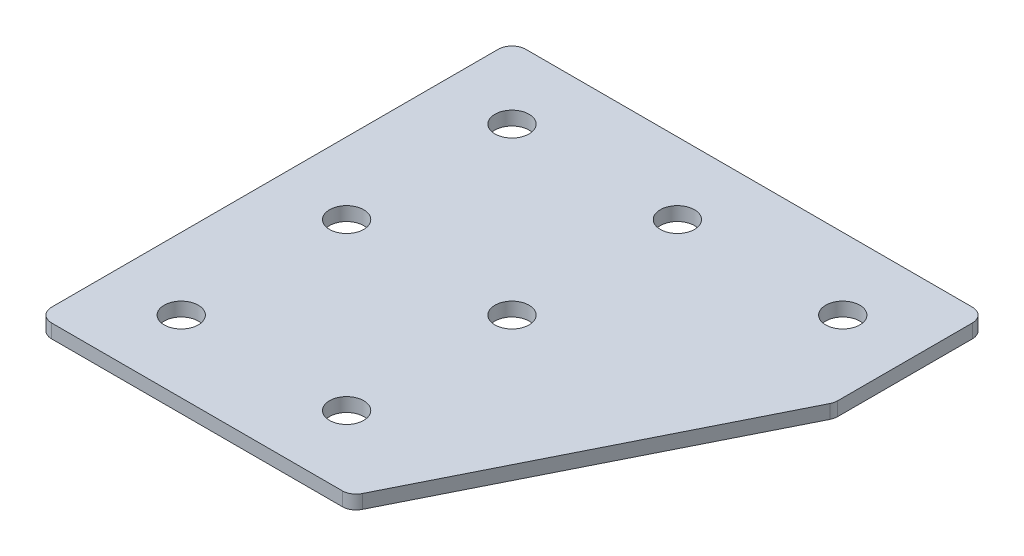
ISO-10303-21;
HEADER;
FILE_DESCRIPTION(('STEP AP214'),'2;1');
FILE_NAME('part.step','',(''),(''),'','','');
FILE_SCHEMA(('AUTOMOTIVE_DESIGN { 1 0 10303 214 1 1 1 1 }'));
ENDSEC;
DATA;
#1=APPLICATION_CONTEXT('core data for automotive mechanical design processes');
#2=APPLICATION_PROTOCOL_DEFINITION('international standard','automotive_design',2000,#1);
#3=PRODUCT_CONTEXT('',#1,'mechanical');
#4=PRODUCT('Part','Part','',(#3));
#5=PRODUCT_RELATED_PRODUCT_CATEGORY('part','',(#4));
#6=PRODUCT_DEFINITION_FORMATION('','',#4);
#7=PRODUCT_DEFINITION_CONTEXT('part definition',#1,'design');
#8=PRODUCT_DEFINITION('design','',#6,#7);
#9=PRODUCT_DEFINITION_SHAPE('','',#8);
#10=(LENGTH_UNIT() NAMED_UNIT(*) SI_UNIT(.MILLI.,.METRE.));
#11=(NAMED_UNIT(*) PLANE_ANGLE_UNIT() SI_UNIT($,.RADIAN.));
#12=(NAMED_UNIT(*) SI_UNIT($,.STERADIAN.) SOLID_ANGLE_UNIT());
#13=UNCERTAINTY_MEASURE_WITH_UNIT(LENGTH_MEASURE(1.E-05),#10,'distance_accuracy_value','');
#14=(GEOMETRIC_REPRESENTATION_CONTEXT(3) GLOBAL_UNCERTAINTY_ASSIGNED_CONTEXT((#13)) GLOBAL_UNIT_ASSIGNED_CONTEXT((#10,
#11,#12)) REPRESENTATION_CONTEXT('',''));
#15=CARTESIAN_POINT('',(0.,0.,0.));
#16=DIRECTION('',(0.,0.,1.));
#17=DIRECTION('',(1.,0.,0.));
#18=AXIS2_PLACEMENT_3D('',#15,#16,#17);
#19=CARTESIAN_POINT('',(-17.01632682041,1.45798729371791,-30.6912203853062));
#20=DIRECTION('',(0.,-1.,0.));
#21=DIRECTION('',(0.,0.,-1.));
#22=AXIS2_PLACEMENT_3D('',#19,#20,#21);
#23=PLANE('',#22);
#24=CARTESIAN_POINT('',(-2.01632682040997,1.45798729371791,29.3087796146938));
#25=DIRECTION('',(0.,1.,0.));
#26=DIRECTION('',(0.,0.,1.));
#27=AXIS2_PLACEMENT_3D('',#24,#25,#26);
#28=CIRCLE('',#27,3.1);
#29=CARTESIAN_POINT('',(-2.01632682040997,1.45798729371791,32.4087796146938));
#30=VERTEX_POINT('',#29);
#31=EDGE_CURVE('E255',#30,#30,#28,.T.);
#32=ORIENTED_EDGE('',*,*,#31,.T.);
#33=EDGE_LOOP('',(#32));
#34=FACE_BOUND('',#33,.T.);
#35=CARTESIAN_POINT('',(-32.01632682041,1.45798729371791,29.3087796146938));
#36=DIRECTION('',(0.,1.,0.));
#37=DIRECTION('',(0.,0.,1.));
#38=AXIS2_PLACEMENT_3D('',#35,#36,#37);
#39=CIRCLE('',#38,3.1);
#40=CARTESIAN_POINT('',(-32.01632682041,1.45798729371791,32.4087796146938));
#41=VERTEX_POINT('',#40);
#42=EDGE_CURVE('E263',#41,#41,#39,.T.);
#43=ORIENTED_EDGE('',*,*,#42,.T.);
#44=EDGE_LOOP('',(#43));
#45=FACE_BOUND('',#44,.T.);
#46=CARTESIAN_POINT('',(-2.01632682040996,1.45798729371791,-0.691220385306168));
#47=DIRECTION('',(0.,1.,0.));
#48=DIRECTION('',(0.,0.,1.));
#49=AXIS2_PLACEMENT_3D('',#46,#47,#48);
#50=CIRCLE('',#49,3.1);
#51=CARTESIAN_POINT('',(-2.01632682040996,1.45798729371791,2.40877961469383));
#52=VERTEX_POINT('',#51);
#53=EDGE_CURVE('E269',#52,#52,#50,.T.);
#54=ORIENTED_EDGE('',*,*,#53,.T.);
#55=EDGE_LOOP('',(#54));
#56=FACE_BOUND('',#55,.T.);
#57=CARTESIAN_POINT('',(-32.01632682041,1.45798729371791,-0.691220385306168));
#58=DIRECTION('',(0.,1.,0.));
#59=DIRECTION('',(0.,0.,1.));
#60=AXIS2_PLACEMENT_3D('',#57,#58,#59);
#61=CIRCLE('',#60,3.1);
#62=CARTESIAN_POINT('',(-32.01632682041,1.45798729371791,2.40877961469383));
#63=VERTEX_POINT('',#62);
#64=EDGE_CURVE('E275',#63,#63,#61,.T.);
#65=ORIENTED_EDGE('',*,*,#64,.T.);
#66=EDGE_LOOP('',(#65));
#67=FACE_BOUND('',#66,.T.);
#68=CARTESIAN_POINT('',(27.98367317959,1.45798729371791,-30.6912203853062));
#69=DIRECTION('',(0.,1.,0.));
#70=DIRECTION('',(0.,0.,1.));
#71=AXIS2_PLACEMENT_3D('',#68,#69,#70);
#72=CIRCLE('',#71,3.1);
#73=CARTESIAN_POINT('',(27.98367317959,1.45798729371791,-27.5912203853062));
#74=VERTEX_POINT('',#73);
#75=EDGE_CURVE('E281',#74,#74,#72,.T.);
#76=ORIENTED_EDGE('',*,*,#75,.T.);
#77=EDGE_LOOP('',(#76));
#78=FACE_BOUND('',#77,.T.);
#79=CARTESIAN_POINT('',(-2.01632682040996,1.45798729371791,-30.6912203853062));
#80=DIRECTION('',(0.,1.,0.));
#81=DIRECTION('',(0.,0.,1.));
#82=AXIS2_PLACEMENT_3D('',#79,#80,#81);
#83=CIRCLE('',#82,3.1);
#84=CARTESIAN_POINT('',(-2.01632682040996,1.45798729371791,-27.5912203853062));
#85=VERTEX_POINT('',#84);
#86=EDGE_CURVE('E287',#85,#85,#83,.T.);
#87=ORIENTED_EDGE('',*,*,#86,.T.);
#88=EDGE_LOOP('',(#87));
#89=FACE_BOUND('',#88,.T.);
#90=CARTESIAN_POINT('',(-32.01632682041,1.45798729371791,-30.6912203853062));
#91=DIRECTION('',(0.,1.,0.));
#92=DIRECTION('',(0.,0.,1.));
#93=AXIS2_PLACEMENT_3D('',#90,#91,#92);
#94=CIRCLE('',#93,3.1);
#95=CARTESIAN_POINT('',(-32.01632682041,1.45798729371791,-27.5912203853062));
#96=VERTEX_POINT('',#95);
#97=EDGE_CURVE('E175',#96,#96,#94,.T.);
#98=ORIENTED_EDGE('',*,*,#97,.T.);
#99=EDGE_LOOP('',(#98));
#100=FACE_BOUND('',#99,.T.);
#101=DIRECTION('',(1.,0.,0.));
#102=VECTOR('',#101,1.);
#103=CARTESIAN_POINT('',(-45.0163268204101,1.45798729371791,42.3087796146938));
#104=LINE('',#103,#102);
#105=CARTESIAN_POINT('',(-42.5163268204101,1.45798729371791,42.3087796146938));
#106=VERTEX_POINT('',#105);
#107=CARTESIAN_POINT('',(10.2025202302156,1.45798729371791,42.3087796146938));
#108=VERTEX_POINT('',#107);
#109=EDGE_CURVE('E121',#106,#108,#104,.T.);
#110=ORIENTED_EDGE('',*,*,#109,.F.);
#111=CARTESIAN_POINT('',(-42.5163268204101,1.45798729371791,39.8087796146938));
#112=DIRECTION('',(0.,-1.,0.));
#113=DIRECTION('',(0.,0.,-1.));
#114=AXIS2_PLACEMENT_3D('',#111,#112,#113);
#115=CIRCLE('',#114,2.5);
#116=CARTESIAN_POINT('',(-45.0163268204101,1.45798729371791,39.8087796146938));
#117=VERTEX_POINT('',#116);
#118=EDGE_CURVE('E145',#106,#117,#115,.T.);
#119=ORIENTED_EDGE('',*,*,#118,.T.);
#120=DIRECTION('',(0.,0.,1.));
#121=VECTOR('',#120,1.);
#122=CARTESIAN_POINT('',(-45.0163268204101,1.45798729371791,-43.6912203853062));
#123=LINE('',#122,#121);
#124=CARTESIAN_POINT('',(-45.0163268204101,1.45798729371791,-41.1912203853062));
#125=VERTEX_POINT('',#124);
#126=EDGE_CURVE('E162',#125,#117,#123,.T.);
#127=ORIENTED_EDGE('',*,*,#126,.F.);
#128=CARTESIAN_POINT('',(-42.5163268204101,1.45798729371791,-41.1912203853062));
#129=DIRECTION('',(0.,-1.,0.));
#130=DIRECTION('',(0.,0.,-1.));
#131=AXIS2_PLACEMENT_3D('',#128,#129,#130);
#132=CIRCLE('',#131,2.5);
#133=CARTESIAN_POINT('',(-42.5163268204101,1.45798729371791,-43.6912203853062));
#134=VERTEX_POINT('',#133);
#135=EDGE_CURVE('E117',#125,#134,#132,.T.);
#136=ORIENTED_EDGE('',*,*,#135,.T.);
#137=DIRECTION('',(-1.,0.,0.));
#138=VECTOR('',#137,1.);
#139=CARTESIAN_POINT('',(40.9836731795899,1.45798729371791,-43.6912203853062));
#140=LINE('',#139,#138);
#141=CARTESIAN_POINT('',(38.4836731795899,1.45798729371791,-43.6912203853062));
#142=VERTEX_POINT('',#141);
#143=EDGE_CURVE('E160',#142,#134,#140,.T.);
#144=ORIENTED_EDGE('',*,*,#143,.F.);
#145=CARTESIAN_POINT('',(38.4836731795899,1.45798729371791,-41.1912203853062));
#146=DIRECTION('',(0.,-1.,0.));
#147=DIRECTION('',(0.,0.,-1.));
#148=AXIS2_PLACEMENT_3D('',#145,#146,#147);
#149=CIRCLE('',#148,2.5);
#150=CARTESIAN_POINT('',(40.9836731795899,1.45798729371791,-41.1912203853062));
#151=VERTEX_POINT('',#150);
#152=EDGE_CURVE('E140',#142,#151,#149,.T.);
#153=ORIENTED_EDGE('',*,*,#152,.T.);
#154=DIRECTION('',(0.,0.,-1.));
#155=VECTOR('',#154,1.);
#156=CARTESIAN_POINT('',(40.9836731795899,1.45798729371791,-16.1633563403057));
#157=LINE('',#156,#155);
#158=CARTESIAN_POINT('',(40.9836731795899,1.45798729371791,-16.7535262840552));
#159=VERTEX_POINT('',#158);
#160=EDGE_CURVE('E163',#159,#151,#157,.T.);
#161=ORIENTED_EDGE('',*,*,#160,.F.);
#162=CARTESIAN_POINT('',(38.4836731795899,1.45798729371791,-16.7535262840552));
#163=DIRECTION('',(0.,-1.,0.));
#164=DIRECTION('',(0.,0.,-1.));
#165=AXIS2_PLACEMENT_3D('',#162,#163,#164);
#166=CIRCLE('',#165,2.5);
#167=CARTESIAN_POINT('',(40.7197411570897,1.45798729371791,-15.6354922953053));
#168=VERTEX_POINT('',#167);
#169=EDGE_CURVE('E31',#159,#168,#166,.T.);
#170=ORIENTED_EDGE('',*,*,#169,.T.);
#171=DIRECTION('',(0.447213595499956,0.,-0.894427190999917));
#172=VECTOR('',#171,1.);
#173=CARTESIAN_POINT('',(11.7476052020903,1.45798729371791,42.3087796146938));
#174=LINE('',#173,#172);
#175=CARTESIAN_POINT('',(12.4385882077154,1.45798729371791,40.9268136034437));
#176=VERTEX_POINT('',#175);
#177=EDGE_CURVE('E118',#176,#168,#174,.T.);
#178=ORIENTED_EDGE('',*,*,#177,.F.);
#179=CARTESIAN_POINT('',(10.2025202302156,1.45798729371791,39.8087796146938));
#180=DIRECTION('',(0.,-1.,0.));
#181=DIRECTION('',(0.,0.,-1.));
#182=AXIS2_PLACEMENT_3D('',#179,#180,#181);
#183=CIRCLE('',#182,2.5);
#184=EDGE_CURVE('E143',#176,#108,#183,.T.);
#185=ORIENTED_EDGE('',*,*,#184,.T.);
#186=EDGE_LOOP('',(#110,#119,#127,#136,#144,#153,#161,#170,#178,#185));
#187=FACE_BOUND('',#186,.T.);
#188=ADVANCED_FACE('F16',(#34,#45,#56,#67,#78,#89,#100,#187),#23,.T.);
#189=CARTESIAN_POINT('',(40.9836731795899,1.45798729371791,-16.1633563403057));
#190=DIRECTION('',(1.,0.,0.));
#191=DIRECTION('',(0.,0.,-1.));
#192=AXIS2_PLACEMENT_3D('',#189,#190,#191);
#193=PLANE('',#192);
#194=DIRECTION('',(0.,0.,-1.));
#195=VECTOR('',#194,1.);
#196=CARTESIAN_POINT('',(40.9836731795899,3.95798729371791,-16.1633563403057));
#197=LINE('',#196,#195);
#198=CARTESIAN_POINT('',(40.9836731795899,3.95798729371791,-16.7535262840552));
#199=VERTEX_POINT('',#198);
#200=CARTESIAN_POINT('',(40.9836731795899,3.95798729371791,-41.1912203853062));
#201=VERTEX_POINT('',#200);
#202=EDGE_CURVE('E172',#199,#201,#197,.T.);
#203=ORIENTED_EDGE('',*,*,#202,.F.);
#204=DIRECTION('',(0.,1.,0.));
#205=VECTOR('',#204,1.);
#206=CARTESIAN_POINT('',(40.9836731795899,1.45798729371791,-16.7535262840552));
#207=LINE('',#206,#205);
#208=EDGE_CURVE('E154',#199,#159,#207,.F.);
#209=ORIENTED_EDGE('',*,*,#208,.T.);
#210=ORIENTED_EDGE('',*,*,#160,.T.);
#211=DIRECTION('',(0.,1.,0.));
#212=VECTOR('',#211,1.);
#213=CARTESIAN_POINT('',(40.9836731795899,1.45798729371791,-41.1912203853062));
#214=LINE('',#213,#212);
#215=EDGE_CURVE('E151',#151,#201,#214,.T.);
#216=ORIENTED_EDGE('',*,*,#215,.T.);
#217=EDGE_LOOP('',(#203,#209,#210,#216));
#218=FACE_BOUND('',#217,.T.);
#219=ADVANCED_FACE('F206',(#218),#193,.T.);
#220=CARTESIAN_POINT('',(11.7476052020903,1.45798729371791,42.3087796146938));
#221=DIRECTION('',(0.894427190999917,0.,0.447213595499956));
#222=DIRECTION('',(0.447213595499956,0.,-0.894427190999917));
#223=AXIS2_PLACEMENT_3D('',#220,#221,#222);
#224=PLANE('',#223);
#225=DIRECTION('',(0.447213595499956,0.,-0.894427190999917));
#226=VECTOR('',#225,1.);
#227=CARTESIAN_POINT('',(11.7476052020903,3.95798729371791,42.3087796146938));
#228=LINE('',#227,#226);
#229=CARTESIAN_POINT('',(12.4385882077154,3.95798729371791,40.9268136034437));
#230=VERTEX_POINT('',#229);
#231=CARTESIAN_POINT('',(40.7197411570897,3.95798729371791,-15.6354922953053));
#232=VERTEX_POINT('',#231);
#233=EDGE_CURVE('E124',#230,#232,#228,.T.);
#234=ORIENTED_EDGE('',*,*,#233,.F.);
#235=DIRECTION('',(0.,1.,0.));
#236=VECTOR('',#235,1.);
#237=CARTESIAN_POINT('',(12.4385882077154,1.45798729371791,40.9268136034437));
#238=LINE('',#237,#236);
#239=EDGE_CURVE('E38',#230,#176,#238,.F.);
#240=ORIENTED_EDGE('',*,*,#239,.T.);
#241=ORIENTED_EDGE('',*,*,#177,.T.);
#242=DIRECTION('',(0.,1.,0.));
#243=VECTOR('',#242,1.);
#244=CARTESIAN_POINT('',(40.7197411570897,1.45798729371791,-15.6354922953053));
#245=LINE('',#244,#243);
#246=EDGE_CURVE('E147',#168,#232,#245,.T.);
#247=ORIENTED_EDGE('',*,*,#246,.T.);
#248=EDGE_LOOP('',(#234,#240,#241,#247));
#249=FACE_BOUND('',#248,.T.);
#250=ADVANCED_FACE('F180',(#249),#224,.T.);
#251=CARTESIAN_POINT('',(-45.0163268204101,1.45798729371791,42.3087796146938));
#252=DIRECTION('',(0.,0.,1.));
#253=DIRECTION('',(1.,0.,0.));
#254=AXIS2_PLACEMENT_3D('',#251,#252,#253);
#255=PLANE('',#254);
#256=DIRECTION('',(1.,0.,0.));
#257=VECTOR('',#256,1.);
#258=CARTESIAN_POINT('',(-45.0163268204101,3.95798729371791,42.3087796146938));
#259=LINE('',#258,#257);
#260=CARTESIAN_POINT('',(-42.5163268204101,3.95798729371791,42.3087796146938));
#261=VERTEX_POINT('',#260);
#262=CARTESIAN_POINT('',(10.2025202302156,3.95798729371791,42.3087796146938));
#263=VERTEX_POINT('',#262);
#264=EDGE_CURVE('E114',#261,#263,#259,.T.);
#265=ORIENTED_EDGE('',*,*,#264,.F.);
#266=DIRECTION('',(0.,1.,0.));
#267=VECTOR('',#266,1.);
#268=CARTESIAN_POINT('',(-42.5163268204101,1.45798729371791,42.3087796146938));
#269=LINE('',#268,#267);
#270=EDGE_CURVE('E137',#261,#106,#269,.F.);
#271=ORIENTED_EDGE('',*,*,#270,.T.);
#272=ORIENTED_EDGE('',*,*,#109,.T.);
#273=DIRECTION('',(0.,1.,0.));
#274=VECTOR('',#273,1.);
#275=CARTESIAN_POINT('',(10.2025202302156,1.45798729371791,42.3087796146938));
#276=LINE('',#275,#274);
#277=EDGE_CURVE('E134',#108,#263,#276,.T.);
#278=ORIENTED_EDGE('',*,*,#277,.T.);
#279=EDGE_LOOP('',(#265,#271,#272,#278));
#280=FACE_BOUND('',#279,.T.);
#281=ADVANCED_FACE('F189',(#280),#255,.T.);
#282=CARTESIAN_POINT('',(-45.0163268204101,1.45798729371791,-43.6912203853062));
#283=DIRECTION('',(-1.,0.,0.));
#284=DIRECTION('',(0.,0.,1.));
#285=AXIS2_PLACEMENT_3D('',#282,#283,#284);
#286=PLANE('',#285);
#287=ORIENTED_EDGE('',*,*,#126,.T.);
#288=DIRECTION('',(0.,1.,0.));
#289=VECTOR('',#288,1.);
#290=CARTESIAN_POINT('',(-45.0163268204101,1.45798729371791,39.8087796146938));
#291=LINE('',#290,#289);
#292=CARTESIAN_POINT('',(-45.0163268204101,3.95798729371791,39.8087796146938));
#293=VERTEX_POINT('',#292);
#294=EDGE_CURVE('E105',#117,#293,#291,.T.);
#295=ORIENTED_EDGE('',*,*,#294,.T.);
#296=DIRECTION('',(0.,0.,1.));
#297=VECTOR('',#296,1.);
#298=CARTESIAN_POINT('',(-45.0163268204101,3.95798729371791,-43.6912203853062));
#299=LINE('',#298,#297);
#300=CARTESIAN_POINT('',(-45.0163268204101,3.95798729371791,-41.1912203853062));
#301=VERTEX_POINT('',#300);
#302=EDGE_CURVE('E97',#301,#293,#299,.T.);
#303=ORIENTED_EDGE('',*,*,#302,.F.);
#304=DIRECTION('',(0.,1.,0.));
#305=VECTOR('',#304,1.);
#306=CARTESIAN_POINT('',(-45.0163268204101,1.45798729371791,-41.1912203853062));
#307=LINE('',#306,#305);
#308=EDGE_CURVE('E111',#301,#125,#307,.F.);
#309=ORIENTED_EDGE('',*,*,#308,.T.);
#310=EDGE_LOOP('',(#287,#295,#303,#309));
#311=FACE_BOUND('',#310,.T.);
#312=ADVANCED_FACE('F110',(#311),#286,.T.);
#313=CARTESIAN_POINT('',(40.9836731795899,1.45798729371791,-43.6912203853062));
#314=DIRECTION('',(0.,0.,-1.));
#315=DIRECTION('',(-1.,0.,0.));
#316=AXIS2_PLACEMENT_3D('',#313,#314,#315);
#317=PLANE('',#316);
#318=DIRECTION('',(-1.,0.,0.));
#319=VECTOR('',#318,1.);
#320=CARTESIAN_POINT('',(40.9836731795899,3.95798729371791,-43.6912203853062));
#321=LINE('',#320,#319);
#322=CARTESIAN_POINT('',(38.4836731795899,3.95798729371791,-43.6912203853062));
#323=VERTEX_POINT('',#322);
#324=CARTESIAN_POINT('',(-42.5163268204101,3.95798729371791,-43.6912203853062));
#325=VERTEX_POINT('',#324);
#326=EDGE_CURVE('E99',#323,#325,#321,.T.);
#327=ORIENTED_EDGE('',*,*,#326,.F.);
#328=DIRECTION('',(0.,1.,0.));
#329=VECTOR('',#328,1.);
#330=CARTESIAN_POINT('',(38.4836731795899,1.45798729371791,-43.6912203853062));
#331=LINE('',#330,#329);
#332=EDGE_CURVE('E10',#323,#142,#331,.F.);
#333=ORIENTED_EDGE('',*,*,#332,.T.);
#334=ORIENTED_EDGE('',*,*,#143,.T.);
#335=DIRECTION('',(0.,1.,0.));
#336=VECTOR('',#335,1.);
#337=CARTESIAN_POINT('',(-42.5163268204101,1.45798729371791,-43.6912203853062));
#338=LINE('',#337,#336);
#339=EDGE_CURVE('E24',#134,#325,#338,.T.);
#340=ORIENTED_EDGE('',*,*,#339,.T.);
#341=EDGE_LOOP('',(#327,#333,#334,#340));
#342=FACE_BOUND('',#341,.T.);
#343=ADVANCED_FACE('F157',(#342),#317,.T.);
#344=CARTESIAN_POINT('',(-17.01632682041,3.95798729371791,-30.6912203853062));
#345=DIRECTION('',(0.,-1.,0.));
#346=DIRECTION('',(0.,0.,-1.));
#347=AXIS2_PLACEMENT_3D('',#344,#345,#346);
#348=PLANE('',#347);
#349=CARTESIAN_POINT('',(-2.01632682040997,3.95798729371791,29.3087796146938));
#350=DIRECTION('',(0.,1.,0.));
#351=DIRECTION('',(0.,0.,1.));
#352=AXIS2_PLACEMENT_3D('',#349,#350,#351);
#353=CIRCLE('',#352,3.1);
#354=CARTESIAN_POINT('',(-2.01632682040997,3.95798729371791,32.4087796146938));
#355=VERTEX_POINT('',#354);
#356=EDGE_CURVE('E258',#355,#355,#353,.T.);
#357=ORIENTED_EDGE('',*,*,#356,.F.);
#358=EDGE_LOOP('',(#357));
#359=FACE_BOUND('',#358,.T.);
#360=CARTESIAN_POINT('',(-32.01632682041,3.95798729371791,29.3087796146938));
#361=DIRECTION('',(0.,1.,0.));
#362=DIRECTION('',(0.,0.,1.));
#363=AXIS2_PLACEMENT_3D('',#360,#361,#362);
#364=CIRCLE('',#363,3.1);
#365=CARTESIAN_POINT('',(-32.01632682041,3.95798729371791,32.4087796146938));
#366=VERTEX_POINT('',#365);
#367=EDGE_CURVE('E260',#366,#366,#364,.T.);
#368=ORIENTED_EDGE('',*,*,#367,.F.);
#369=EDGE_LOOP('',(#368));
#370=FACE_BOUND('',#369,.T.);
#371=CARTESIAN_POINT('',(-2.01632682040996,3.95798729371791,-0.691220385306168));
#372=DIRECTION('',(0.,1.,0.));
#373=DIRECTION('',(0.,0.,1.));
#374=AXIS2_PLACEMENT_3D('',#371,#372,#373);
#375=CIRCLE('',#374,3.1);
#376=CARTESIAN_POINT('',(-2.01632682040996,3.95798729371791,2.40877961469383));
#377=VERTEX_POINT('',#376);
#378=EDGE_CURVE('E266',#377,#377,#375,.T.);
#379=ORIENTED_EDGE('',*,*,#378,.F.);
#380=EDGE_LOOP('',(#379));
#381=FACE_BOUND('',#380,.T.);
#382=CARTESIAN_POINT('',(-32.01632682041,3.95798729371791,-0.691220385306168));
#383=DIRECTION('',(0.,1.,0.));
#384=DIRECTION('',(0.,0.,1.));
#385=AXIS2_PLACEMENT_3D('',#382,#383,#384);
#386=CIRCLE('',#385,3.1);
#387=CARTESIAN_POINT('',(-32.01632682041,3.95798729371791,2.40877961469383));
#388=VERTEX_POINT('',#387);
#389=EDGE_CURVE('E272',#388,#388,#386,.T.);
#390=ORIENTED_EDGE('',*,*,#389,.F.);
#391=EDGE_LOOP('',(#390));
#392=FACE_BOUND('',#391,.T.);
#393=CARTESIAN_POINT('',(27.98367317959,3.95798729371791,-30.6912203853062));
#394=DIRECTION('',(0.,1.,0.));
#395=DIRECTION('',(0.,0.,1.));
#396=AXIS2_PLACEMENT_3D('',#393,#394,#395);
#397=CIRCLE('',#396,3.1);
#398=CARTESIAN_POINT('',(27.98367317959,3.95798729371791,-27.5912203853062));
#399=VERTEX_POINT('',#398);
#400=EDGE_CURVE('E278',#399,#399,#397,.T.);
#401=ORIENTED_EDGE('',*,*,#400,.F.);
#402=EDGE_LOOP('',(#401));
#403=FACE_BOUND('',#402,.T.);
#404=CARTESIAN_POINT('',(-2.01632682040996,3.95798729371791,-30.6912203853062));
#405=DIRECTION('',(0.,1.,0.));
#406=DIRECTION('',(0.,0.,1.));
#407=AXIS2_PLACEMENT_3D('',#404,#405,#406);
#408=CIRCLE('',#407,3.1);
#409=CARTESIAN_POINT('',(-2.01632682040996,3.95798729371791,-27.5912203853062));
#410=VERTEX_POINT('',#409);
#411=EDGE_CURVE('E284',#410,#410,#408,.T.);
#412=ORIENTED_EDGE('',*,*,#411,.F.);
#413=EDGE_LOOP('',(#412));
#414=FACE_BOUND('',#413,.T.);
#415=CARTESIAN_POINT('',(-32.01632682041,3.95798729371791,-30.6912203853062));
#416=DIRECTION('',(0.,1.,0.));
#417=DIRECTION('',(0.,0.,1.));
#418=AXIS2_PLACEMENT_3D('',#415,#416,#417);
#419=CIRCLE('',#418,3.1);
#420=CARTESIAN_POINT('',(-32.01632682041,3.95798729371791,-27.5912203853062));
#421=VERTEX_POINT('',#420);
#422=EDGE_CURVE('E290',#421,#421,#419,.T.);
#423=ORIENTED_EDGE('',*,*,#422,.F.);
#424=EDGE_LOOP('',(#423));
#425=FACE_BOUND('',#424,.T.);
#426=ORIENTED_EDGE('',*,*,#302,.T.);
#427=CARTESIAN_POINT('',(-42.5163268204101,3.95798729371791,39.8087796146938));
#428=DIRECTION('',(0.,-1.,0.));
#429=DIRECTION('',(0.,0.,-1.));
#430=AXIS2_PLACEMENT_3D('',#427,#428,#429);
#431=CIRCLE('',#430,2.5);
#432=EDGE_CURVE('E132',#293,#261,#431,.F.);
#433=ORIENTED_EDGE('',*,*,#432,.T.);
#434=ORIENTED_EDGE('',*,*,#264,.T.);
#435=CARTESIAN_POINT('',(10.2025202302156,3.95798729371791,39.8087796146938));
#436=DIRECTION('',(0.,-1.,0.));
#437=DIRECTION('',(0.,0.,-1.));
#438=AXIS2_PLACEMENT_3D('',#435,#436,#437);
#439=CIRCLE('',#438,2.5);
#440=EDGE_CURVE('E130',#263,#230,#439,.F.);
#441=ORIENTED_EDGE('',*,*,#440,.T.);
#442=ORIENTED_EDGE('',*,*,#233,.T.);
#443=CARTESIAN_POINT('',(38.4836731795899,3.95798729371791,-16.7535262840552));
#444=DIRECTION('',(0.,-1.,0.));
#445=DIRECTION('',(0.,0.,-1.));
#446=AXIS2_PLACEMENT_3D('',#443,#444,#445);
#447=CIRCLE('',#446,2.5);
#448=EDGE_CURVE('E128',#232,#199,#447,.F.);
#449=ORIENTED_EDGE('',*,*,#448,.T.);
#450=ORIENTED_EDGE('',*,*,#202,.T.);
#451=CARTESIAN_POINT('',(38.4836731795899,3.95798729371791,-41.1912203853062));
#452=DIRECTION('',(0.,-1.,0.));
#453=DIRECTION('',(0.,0.,-1.));
#454=AXIS2_PLACEMENT_3D('',#451,#452,#453);
#455=CIRCLE('',#454,2.5);
#456=EDGE_CURVE('E104',#201,#323,#455,.F.);
#457=ORIENTED_EDGE('',*,*,#456,.T.);
#458=ORIENTED_EDGE('',*,*,#326,.T.);
#459=CARTESIAN_POINT('',(-42.5163268204101,3.95798729371791,-41.1912203853062));
#460=DIRECTION('',(0.,-1.,0.));
#461=DIRECTION('',(0.,0.,-1.));
#462=AXIS2_PLACEMENT_3D('',#459,#460,#461);
#463=CIRCLE('',#462,2.5);
#464=EDGE_CURVE('E94',#325,#301,#463,.F.);
#465=ORIENTED_EDGE('',*,*,#464,.T.);
#466=EDGE_LOOP('',(#426,#433,#434,#441,#442,#449,#450,#457,#458,#465));
#467=FACE_BOUND('',#466,.T.);
#468=ADVANCED_FACE('F96',(#359,#370,#381,#392,#403,#414,#425,#467),#348,.F.);
#469=CARTESIAN_POINT('',(-42.5163268204101,1.45798729371791,39.8087796146938));
#470=DIRECTION('',(0.,1.,0.));
#471=DIRECTION('',(0.,0.,1.));
#472=AXIS2_PLACEMENT_3D('',#469,#470,#471);
#473=CYLINDRICAL_SURFACE('',#472,2.5);
#474=ORIENTED_EDGE('',*,*,#118,.F.);
#475=ORIENTED_EDGE('',*,*,#270,.F.);
#476=ORIENTED_EDGE('',*,*,#432,.F.);
#477=ORIENTED_EDGE('',*,*,#294,.F.);
#478=EDGE_LOOP('',(#474,#475,#476,#477));
#479=FACE_BOUND('',#478,.T.);
#480=ADVANCED_FACE('F192',(#479),#473,.T.);
#481=CARTESIAN_POINT('',(10.2025202302156,1.45798729371791,39.8087796146938));
#482=DIRECTION('',(0.,1.,0.));
#483=DIRECTION('',(0.,0.,1.));
#484=AXIS2_PLACEMENT_3D('',#481,#482,#483);
#485=CYLINDRICAL_SURFACE('',#484,2.5);
#486=ORIENTED_EDGE('',*,*,#184,.F.);
#487=ORIENTED_EDGE('',*,*,#239,.F.);
#488=ORIENTED_EDGE('',*,*,#440,.F.);
#489=ORIENTED_EDGE('',*,*,#277,.F.);
#490=EDGE_LOOP('',(#486,#487,#488,#489));
#491=FACE_BOUND('',#490,.T.);
#492=ADVANCED_FACE('F184',(#491),#485,.T.);
#493=CARTESIAN_POINT('',(38.4836731795899,1.45798729371791,-16.7535262840552));
#494=DIRECTION('',(0.,1.,0.));
#495=DIRECTION('',(0.,0.,1.));
#496=AXIS2_PLACEMENT_3D('',#493,#494,#495);
#497=CYLINDRICAL_SURFACE('',#496,2.5);
#498=ORIENTED_EDGE('',*,*,#169,.F.);
#499=ORIENTED_EDGE('',*,*,#208,.F.);
#500=ORIENTED_EDGE('',*,*,#448,.F.);
#501=ORIENTED_EDGE('',*,*,#246,.F.);
#502=EDGE_LOOP('',(#498,#499,#500,#501));
#503=FACE_BOUND('',#502,.T.);
#504=ADVANCED_FACE('F200',(#503),#497,.T.);
#505=CARTESIAN_POINT('',(38.4836731795899,1.45798729371791,-41.1912203853062));
#506=DIRECTION('',(0.,1.,0.));
#507=DIRECTION('',(0.,0.,1.));
#508=AXIS2_PLACEMENT_3D('',#505,#506,#507);
#509=CYLINDRICAL_SURFACE('',#508,2.5);
#510=ORIENTED_EDGE('',*,*,#152,.F.);
#511=ORIENTED_EDGE('',*,*,#332,.F.);
#512=ORIENTED_EDGE('',*,*,#456,.F.);
#513=ORIENTED_EDGE('',*,*,#215,.F.);
#514=EDGE_LOOP('',(#510,#511,#512,#513));
#515=FACE_BOUND('',#514,.T.);
#516=ADVANCED_FACE('F356',(#515),#509,.T.);
#517=CARTESIAN_POINT('',(-42.5163268204101,1.45798729371791,-41.1912203853062));
#518=DIRECTION('',(0.,1.,0.));
#519=DIRECTION('',(0.,0.,1.));
#520=AXIS2_PLACEMENT_3D('',#517,#518,#519);
#521=CYLINDRICAL_SURFACE('',#520,2.5);
#522=ORIENTED_EDGE('',*,*,#135,.F.);
#523=ORIENTED_EDGE('',*,*,#308,.F.);
#524=ORIENTED_EDGE('',*,*,#464,.F.);
#525=ORIENTED_EDGE('',*,*,#339,.F.);
#526=EDGE_LOOP('',(#522,#523,#524,#525));
#527=FACE_BOUND('',#526,.T.);
#528=ADVANCED_FACE('F18',(#527),#521,.T.);
#529=CARTESIAN_POINT('',(-32.01632682041,1.45798729371791,-30.6912203853062));
#530=DIRECTION('',(0.,1.,0.));
#531=DIRECTION('',(0.,0.,1.));
#532=AXIS2_PLACEMENT_3D('',#529,#530,#531);
#533=CYLINDRICAL_SURFACE('',#532,3.1);
#534=ORIENTED_EDGE('',*,*,#97,.F.);
#535=EDGE_LOOP('',(#534));
#536=FACE_BOUND('',#535,.T.);
#537=ORIENTED_EDGE('',*,*,#422,.T.);
#538=EDGE_LOOP('',(#537));
#539=FACE_BOUND('',#538,.T.);
#540=ADVANCED_FACE('F224',(#536,#539),#533,.F.);
#541=CARTESIAN_POINT('',(-2.01632682040996,1.45798729371791,-30.6912203853062));
#542=DIRECTION('',(0.,1.,0.));
#543=DIRECTION('',(0.,0.,1.));
#544=AXIS2_PLACEMENT_3D('',#541,#542,#543);
#545=CYLINDRICAL_SURFACE('',#544,3.1);
#546=ORIENTED_EDGE('',*,*,#86,.F.);
#547=EDGE_LOOP('',(#546));
#548=FACE_BOUND('',#547,.T.);
#549=ORIENTED_EDGE('',*,*,#411,.T.);
#550=EDGE_LOOP('',(#549));
#551=FACE_BOUND('',#550,.T.);
#552=ADVANCED_FACE('F227',(#548,#551),#545,.F.);
#553=CARTESIAN_POINT('',(27.98367317959,1.45798729371791,-30.6912203853062));
#554=DIRECTION('',(0.,1.,0.));
#555=DIRECTION('',(0.,0.,1.));
#556=AXIS2_PLACEMENT_3D('',#553,#554,#555);
#557=CYLINDRICAL_SURFACE('',#556,3.1);
#558=ORIENTED_EDGE('',*,*,#75,.F.);
#559=EDGE_LOOP('',(#558));
#560=FACE_BOUND('',#559,.T.);
#561=ORIENTED_EDGE('',*,*,#400,.T.);
#562=EDGE_LOOP('',(#561));
#563=FACE_BOUND('',#562,.T.);
#564=ADVANCED_FACE('F231',(#560,#563),#557,.F.);
#565=CARTESIAN_POINT('',(-32.01632682041,1.45798729371791,-0.691220385306168));
#566=DIRECTION('',(0.,1.,0.));
#567=DIRECTION('',(0.,0.,1.));
#568=AXIS2_PLACEMENT_3D('',#565,#566,#567);
#569=CYLINDRICAL_SURFACE('',#568,3.1);
#570=ORIENTED_EDGE('',*,*,#64,.F.);
#571=EDGE_LOOP('',(#570));
#572=FACE_BOUND('',#571,.T.);
#573=ORIENTED_EDGE('',*,*,#389,.T.);
#574=EDGE_LOOP('',(#573));
#575=FACE_BOUND('',#574,.T.);
#576=ADVANCED_FACE('F235',(#572,#575),#569,.F.);
#577=CARTESIAN_POINT('',(-2.01632682040996,1.45798729371791,-0.691220385306168));
#578=DIRECTION('',(0.,1.,0.));
#579=DIRECTION('',(0.,0.,1.));
#580=AXIS2_PLACEMENT_3D('',#577,#578,#579);
#581=CYLINDRICAL_SURFACE('',#580,3.1);
#582=ORIENTED_EDGE('',*,*,#53,.F.);
#583=EDGE_LOOP('',(#582));
#584=FACE_BOUND('',#583,.T.);
#585=ORIENTED_EDGE('',*,*,#378,.T.);
#586=EDGE_LOOP('',(#585));
#587=FACE_BOUND('',#586,.T.);
#588=ADVANCED_FACE('F239',(#584,#587),#581,.F.);
#589=CARTESIAN_POINT('',(-32.01632682041,1.45798729371791,29.3087796146938));
#590=DIRECTION('',(0.,1.,0.));
#591=DIRECTION('',(0.,0.,1.));
#592=AXIS2_PLACEMENT_3D('',#589,#590,#591);
#593=CYLINDRICAL_SURFACE('',#592,3.1);
#594=ORIENTED_EDGE('',*,*,#42,.F.);
#595=EDGE_LOOP('',(#594));
#596=FACE_BOUND('',#595,.T.);
#597=ORIENTED_EDGE('',*,*,#367,.T.);
#598=EDGE_LOOP('',(#597));
#599=FACE_BOUND('',#598,.T.);
#600=ADVANCED_FACE('F243',(#596,#599),#593,.F.);
#601=CARTESIAN_POINT('',(-2.01632682040997,1.45798729371791,29.3087796146938));
#602=DIRECTION('',(0.,1.,0.));
#603=DIRECTION('',(0.,0.,1.));
#604=AXIS2_PLACEMENT_3D('',#601,#602,#603);
#605=CYLINDRICAL_SURFACE('',#604,3.1);
#606=ORIENTED_EDGE('',*,*,#31,.F.);
#607=EDGE_LOOP('',(#606));
#608=FACE_BOUND('',#607,.T.);
#609=ORIENTED_EDGE('',*,*,#356,.T.);
#610=EDGE_LOOP('',(#609));
#611=FACE_BOUND('',#610,.T.);
#612=ADVANCED_FACE('F247',(#608,#611),#605,.F.);
#613=CLOSED_SHELL('',(#188,#219,#250,#281,#312,#343,#468,#480,#492,#504,#516,#528,#540,#552,
#564,#576,#588,#600,#612));
#614=MANIFOLD_SOLID_BREP('B1',#613);
#615=ADVANCED_BREP_SHAPE_REPRESENTATION('',(#18,#614),#14);
#616=SHAPE_DEFINITION_REPRESENTATION(#9,#615);
ENDSEC;
END-ISO-10303-21;
